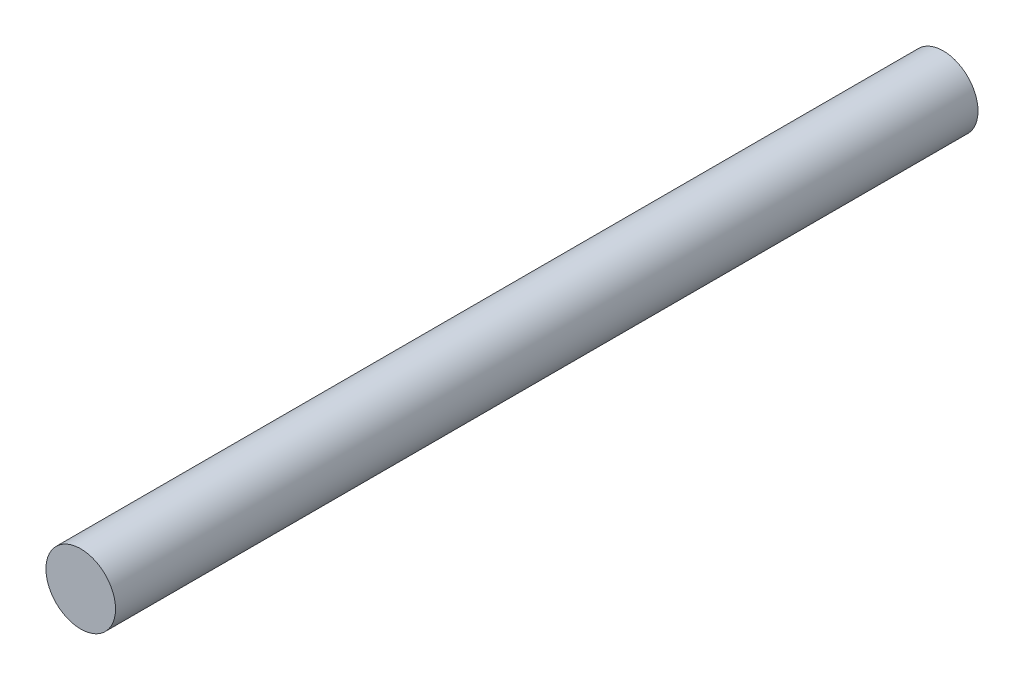
ISO-10303-21;
HEADER;
FILE_DESCRIPTION(('STEP AP214'),'2;1');
FILE_NAME('part.step','',(''),(''),'','','');
FILE_SCHEMA(('AUTOMOTIVE_DESIGN { 1 0 10303 214 1 1 1 1 }'));
ENDSEC;
DATA;
#1=APPLICATION_CONTEXT('core data for automotive mechanical design processes');
#2=APPLICATION_PROTOCOL_DEFINITION('international standard','automotive_design',2000,#1);
#3=PRODUCT_CONTEXT('',#1,'mechanical');
#4=PRODUCT('Part','Part','',(#3));
#5=PRODUCT_RELATED_PRODUCT_CATEGORY('part','',(#4));
#6=PRODUCT_DEFINITION_FORMATION('','',#4);
#7=PRODUCT_DEFINITION_CONTEXT('part definition',#1,'design');
#8=PRODUCT_DEFINITION('design','',#6,#7);
#9=PRODUCT_DEFINITION_SHAPE('','',#8);
#10=(LENGTH_UNIT() NAMED_UNIT(*) SI_UNIT(.MILLI.,.METRE.));
#11=(NAMED_UNIT(*) PLANE_ANGLE_UNIT() SI_UNIT($,.RADIAN.));
#12=(NAMED_UNIT(*) SI_UNIT($,.STERADIAN.) SOLID_ANGLE_UNIT());
#13=UNCERTAINTY_MEASURE_WITH_UNIT(LENGTH_MEASURE(1.E-05),#10,'distance_accuracy_value','');
#14=(GEOMETRIC_REPRESENTATION_CONTEXT(3) GLOBAL_UNCERTAINTY_ASSIGNED_CONTEXT((#13)) GLOBAL_UNIT_ASSIGNED_CONTEXT((#10,
#11,#12)) REPRESENTATION_CONTEXT('',''));
#15=CARTESIAN_POINT('',(0.,0.,0.));
#16=DIRECTION('',(0.,0.,1.));
#17=DIRECTION('',(1.,0.,0.));
#18=AXIS2_PLACEMENT_3D('',#15,#16,#17);
#19=CARTESIAN_POINT('',(0.,0.,59.817));
#20=DIRECTION('',(0.,0.,-1.));
#21=DIRECTION('',(-1.,0.,0.));
#22=AXIS2_PLACEMENT_3D('',#19,#20,#21);
#23=CYLINDRICAL_SURFACE('',#22,2.413);
#24=CARTESIAN_POINT('',(0.,0.,59.817));
#25=DIRECTION('',(0.,0.,1.));
#26=DIRECTION('',(1.,0.,0.));
#27=AXIS2_PLACEMENT_3D('',#24,#25,#26);
#28=CIRCLE('',#27,2.413);
#29=CARTESIAN_POINT('',(2.413,0.,59.817));
#30=VERTEX_POINT('',#29);
#31=EDGE_CURVE('E10',#30,#30,#28,.T.);
#32=ORIENTED_EDGE('',*,*,#31,.F.);
#33=EDGE_LOOP('',(#32));
#34=FACE_BOUND('',#33,.T.);
#35=CARTESIAN_POINT('',(0.,0.,0.));
#36=DIRECTION('',(0.,0.,1.));
#37=DIRECTION('',(1.,0.,0.));
#38=AXIS2_PLACEMENT_3D('',#35,#36,#37);
#39=CIRCLE('',#38,2.413);
#40=CARTESIAN_POINT('',(2.413,0.,0.));
#41=VERTEX_POINT('',#40);
#42=EDGE_CURVE('E40',#41,#41,#39,.T.);
#43=ORIENTED_EDGE('',*,*,#42,.T.);
#44=EDGE_LOOP('',(#43));
#45=FACE_BOUND('',#44,.T.);
#46=ADVANCED_FACE('F37',(#34,#45),#23,.T.);
#47=CARTESIAN_POINT('',(0.,0.,59.817));
#48=DIRECTION('',(0.,0.,1.));
#49=DIRECTION('',(1.,0.,0.));
#50=AXIS2_PLACEMENT_3D('',#47,#48,#49);
#51=PLANE('',#50);
#52=ORIENTED_EDGE('',*,*,#31,.T.);
#53=EDGE_LOOP('',(#52));
#54=FACE_BOUND('',#53,.T.);
#55=ADVANCED_FACE('F54',(#54),#51,.T.);
#56=CARTESIAN_POINT('',(0.,0.,0.));
#57=DIRECTION('',(0.,0.,1.));
#58=DIRECTION('',(1.,0.,0.));
#59=AXIS2_PLACEMENT_3D('',#56,#57,#58);
#60=PLANE('',#59);
#61=ORIENTED_EDGE('',*,*,#42,.F.);
#62=EDGE_LOOP('',(#61));
#63=FACE_BOUND('',#62,.T.);
#64=ADVANCED_FACE('F52',(#63),#60,.F.);
#65=CLOSED_SHELL('',(#46,#55,#64));
#66=MANIFOLD_SOLID_BREP('B2',#65);
#67=ADVANCED_BREP_SHAPE_REPRESENTATION('',(#18,#66),#14);
#68=SHAPE_DEFINITION_REPRESENTATION(#9,#67);
ENDSEC;
END-ISO-10303-21;
